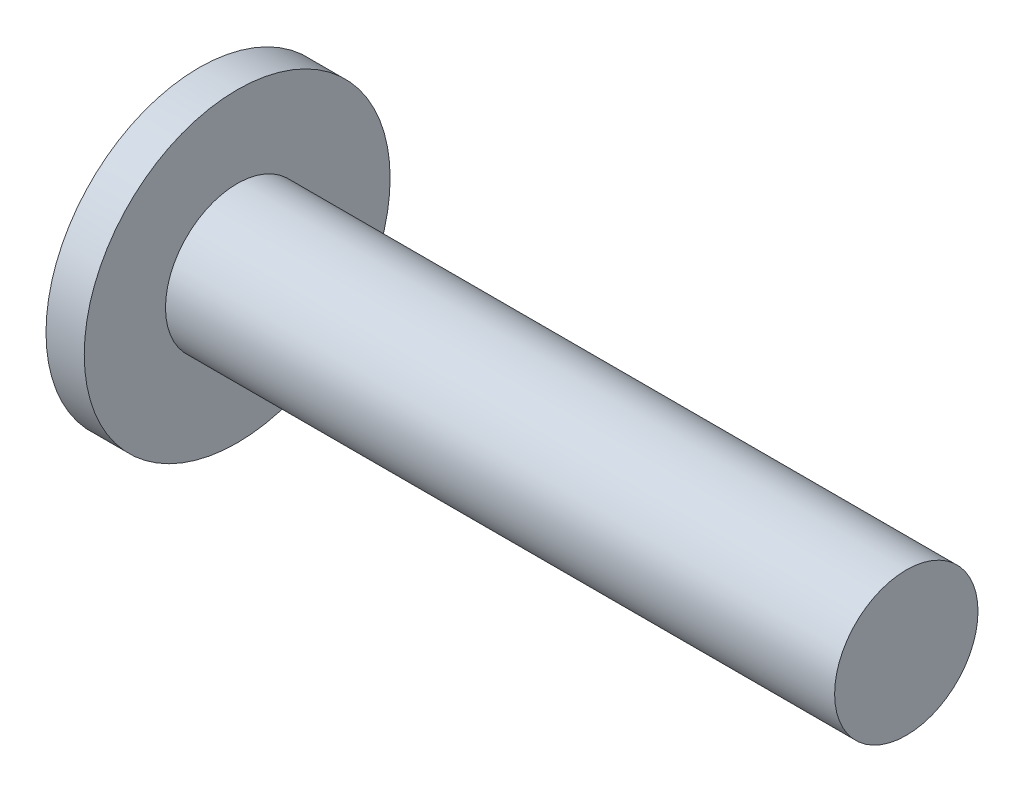
ISO-10303-21;
HEADER;
FILE_DESCRIPTION(('STEP AP214'),'2;1');
FILE_NAME('part.step','',(''),(''),'','','');
FILE_SCHEMA(('AUTOMOTIVE_DESIGN { 1 0 10303 214 1 1 1 1 }'));
ENDSEC;
DATA;
#1=APPLICATION_CONTEXT('core data for automotive mechanical design processes');
#2=APPLICATION_PROTOCOL_DEFINITION('international standard','automotive_design',2000,#1);
#3=PRODUCT_CONTEXT('',#1,'mechanical');
#4=PRODUCT('Part','Part','',(#3));
#5=PRODUCT_RELATED_PRODUCT_CATEGORY('part','',(#4));
#6=PRODUCT_DEFINITION_FORMATION('','',#4);
#7=PRODUCT_DEFINITION_CONTEXT('part definition',#1,'design');
#8=PRODUCT_DEFINITION('design','',#6,#7);
#9=PRODUCT_DEFINITION_SHAPE('','',#8);
#10=(LENGTH_UNIT() NAMED_UNIT(*) SI_UNIT(.MILLI.,.METRE.));
#11=(NAMED_UNIT(*) PLANE_ANGLE_UNIT() SI_UNIT($,.RADIAN.));
#12=(NAMED_UNIT(*) SI_UNIT($,.STERADIAN.) SOLID_ANGLE_UNIT());
#13=UNCERTAINTY_MEASURE_WITH_UNIT(LENGTH_MEASURE(1.E-05),#10,'distance_accuracy_value','');
#14=(GEOMETRIC_REPRESENTATION_CONTEXT(3) GLOBAL_UNCERTAINTY_ASSIGNED_CONTEXT((#13)) GLOBAL_UNIT_ASSIGNED_CONTEXT((#10,
#11,#12)) REPRESENTATION_CONTEXT('',''));
#15=CARTESIAN_POINT('',(0.,0.,0.));
#16=DIRECTION('',(0.,0.,1.));
#17=DIRECTION('',(1.,0.,0.));
#18=AXIS2_PLACEMENT_3D('',#15,#16,#17);
#19=CARTESIAN_POINT('',(18.5,0.,0.));
#20=DIRECTION('',(-1.,0.,0.));
#21=DIRECTION('',(0.,0.,1.));
#22=AXIS2_PLACEMENT_3D('',#19,#20,#21);
#23=CYLINDRICAL_SURFACE('',#22,3.75);
#24=CARTESIAN_POINT('',(18.5,0.,0.));
#25=DIRECTION('',(1.,0.,0.));
#26=DIRECTION('',(0.,0.,-1.));
#27=AXIS2_PLACEMENT_3D('',#24,#25,#26);
#28=CIRCLE('',#27,3.75);
#29=CARTESIAN_POINT('',(18.5,0.,-3.75));
#30=VERTEX_POINT('',#29);
#31=EDGE_CURVE('E37',#30,#30,#28,.T.);
#32=ORIENTED_EDGE('',*,*,#31,.F.);
#33=EDGE_LOOP('',(#32));
#34=FACE_BOUND('',#33,.T.);
#35=CARTESIAN_POINT('',(-16.5,0.,0.));
#36=DIRECTION('',(-1.,0.,0.));
#37=DIRECTION('',(0.,0.,1.));
#38=AXIS2_PLACEMENT_3D('',#35,#36,#37);
#39=CIRCLE('',#38,3.75);
#40=CARTESIAN_POINT('',(-16.5,0.,3.75));
#41=VERTEX_POINT('',#40);
#42=EDGE_CURVE('E10',#41,#41,#39,.T.);
#43=ORIENTED_EDGE('',*,*,#42,.F.);
#44=EDGE_LOOP('',(#43));
#45=FACE_BOUND('',#44,.T.);
#46=ADVANCED_FACE('F31',(#34,#45),#23,.T.);
#47=CARTESIAN_POINT('',(18.5,0.,0.));
#48=DIRECTION('',(1.,0.,0.));
#49=DIRECTION('',(0.,0.,-1.));
#50=AXIS2_PLACEMENT_3D('',#47,#48,#49);
#51=PLANE('',#50);
#52=ORIENTED_EDGE('',*,*,#31,.T.);
#53=EDGE_LOOP('',(#52));
#54=FACE_BOUND('',#53,.T.);
#55=ADVANCED_FACE('F62',(#54),#51,.T.);
#56=CARTESIAN_POINT('',(-16.5,0.,0.));
#57=DIRECTION('',(-1.,0.,0.));
#58=DIRECTION('',(0.,0.,1.));
#59=AXIS2_PLACEMENT_3D('',#56,#57,#58);
#60=PLANE('',#59);
#61=CARTESIAN_POINT('',(-16.5,0.,0.));
#62=DIRECTION('',(-1.,0.,0.));
#63=DIRECTION('',(0.,0.,1.));
#64=AXIS2_PLACEMENT_3D('',#61,#62,#63);
#65=CIRCLE('',#64,8.);
#66=CARTESIAN_POINT('',(-16.5,0.,8.));
#67=VERTEX_POINT('',#66);
#68=EDGE_CURVE('E41',#67,#67,#65,.T.);
#69=ORIENTED_EDGE('',*,*,#68,.F.);
#70=EDGE_LOOP('',(#69));
#71=FACE_BOUND('',#70,.T.);
#72=ORIENTED_EDGE('',*,*,#42,.T.);
#73=EDGE_LOOP('',(#72));
#74=FACE_BOUND('',#73,.T.);
#75=ADVANCED_FACE('F55',(#71,#74),#60,.F.);
#76=CARTESIAN_POINT('',(-16.5,0.,0.));
#77=DIRECTION('',(-1.,0.,0.));
#78=DIRECTION('',(0.,0.,1.));
#79=AXIS2_PLACEMENT_3D('',#76,#77,#78);
#80=CYLINDRICAL_SURFACE('',#79,8.);
#81=ORIENTED_EDGE('',*,*,#68,.T.);
#82=EDGE_LOOP('',(#81));
#83=FACE_BOUND('',#82,.T.);
#84=CARTESIAN_POINT('',(-18.5,0.,0.));
#85=DIRECTION('',(-1.,0.,0.));
#86=DIRECTION('',(0.,0.,1.));
#87=AXIS2_PLACEMENT_3D('',#84,#85,#86);
#88=CIRCLE('',#87,8.);
#89=CARTESIAN_POINT('',(-18.5,0.,8.));
#90=VERTEX_POINT('',#89);
#91=EDGE_CURVE('E45',#90,#90,#88,.T.);
#92=ORIENTED_EDGE('',*,*,#91,.F.);
#93=EDGE_LOOP('',(#92));
#94=FACE_BOUND('',#93,.T.);
#95=ADVANCED_FACE('F53',(#83,#94),#80,.T.);
#96=CARTESIAN_POINT('',(-18.5,0.,0.));
#97=DIRECTION('',(1.,0.,0.));
#98=DIRECTION('',(0.,0.,-1.));
#99=AXIS2_PLACEMENT_3D('',#96,#97,#98);
#100=PLANE('',#99);
#101=ORIENTED_EDGE('',*,*,#91,.T.);
#102=EDGE_LOOP('',(#101));
#103=FACE_BOUND('',#102,.T.);
#104=ADVANCED_FACE('F51',(#103),#100,.F.);
#105=CLOSED_SHELL('',(#46,#55,#75,#95,#104));
#106=MANIFOLD_SOLID_BREP('B2',#105);
#107=ADVANCED_BREP_SHAPE_REPRESENTATION('',(#18,#106),#14);
#108=SHAPE_DEFINITION_REPRESENTATION(#9,#107);
ENDSEC;
END-ISO-10303-21;
